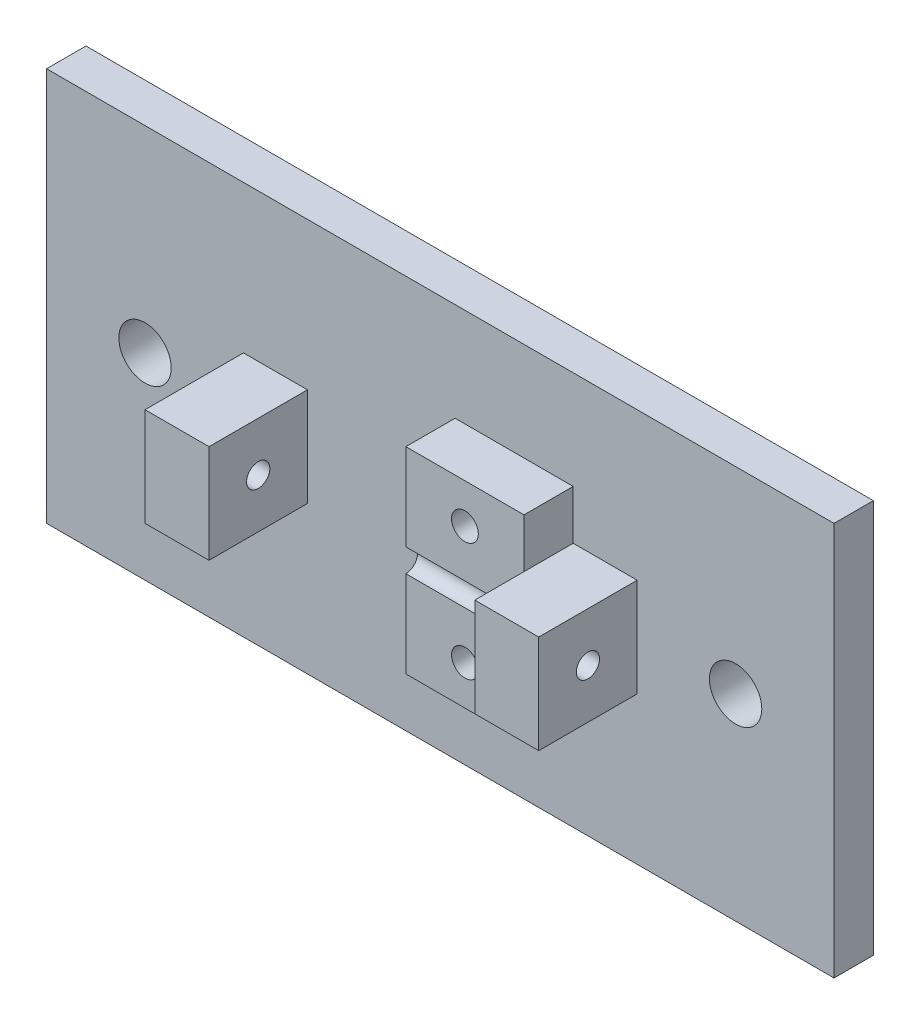
ISO-10303-21;
HEADER;
FILE_DESCRIPTION(('STEP AP214'),'2;1');
FILE_NAME('part.step','',(''),(''),'','','');
FILE_SCHEMA(('AUTOMOTIVE_DESIGN { 1 0 10303 214 1 1 1 1 }'));
ENDSEC;
DATA;
#1=APPLICATION_CONTEXT('core data for automotive mechanical design processes');
#2=APPLICATION_PROTOCOL_DEFINITION('international standard','automotive_design',2000,#1);
#3=PRODUCT_CONTEXT('',#1,'mechanical');
#4=PRODUCT('Part','Part','',(#3));
#5=PRODUCT_RELATED_PRODUCT_CATEGORY('part','',(#4));
#6=PRODUCT_DEFINITION_FORMATION('','',#4);
#7=PRODUCT_DEFINITION_CONTEXT('part definition',#1,'design');
#8=PRODUCT_DEFINITION('design','',#6,#7);
#9=PRODUCT_DEFINITION_SHAPE('','',#8);
#10=(LENGTH_UNIT() NAMED_UNIT(*) SI_UNIT(.MILLI.,.METRE.));
#11=(NAMED_UNIT(*) PLANE_ANGLE_UNIT() SI_UNIT($,.RADIAN.));
#12=(NAMED_UNIT(*) SI_UNIT($,.STERADIAN.) SOLID_ANGLE_UNIT());
#13=UNCERTAINTY_MEASURE_WITH_UNIT(LENGTH_MEASURE(1.E-05),#10,'distance_accuracy_value','');
#14=(GEOMETRIC_REPRESENTATION_CONTEXT(3) GLOBAL_UNCERTAINTY_ASSIGNED_CONTEXT((#13)) GLOBAL_UNIT_ASSIGNED_CONTEXT((#10,
#11,#12)) REPRESENTATION_CONTEXT('',''));
#15=CARTESIAN_POINT('',(0.,0.,0.));
#16=DIRECTION('',(0.,0.,1.));
#17=DIRECTION('',(1.,0.,0.));
#18=AXIS2_PLACEMENT_3D('',#15,#16,#17);
#19=CARTESIAN_POINT('',(0.,0.,5.08));
#20=DIRECTION('',(0.,0.,1.));
#21=DIRECTION('',(1.,0.,0.));
#22=AXIS2_PLACEMENT_3D('',#19,#20,#21);
#23=PLANE('',#22);
#24=DIRECTION('',(-1.,0.,0.));
#25=VECTOR('',#24,1.);
#26=CARTESIAN_POINT('',(0.,-12.7,5.08));
#27=LINE('',#26,#25);
#28=CARTESIAN_POINT('',(17.145,-12.7,5.08));
#29=VERTEX_POINT('',#28);
#30=CARTESIAN_POINT('',(1.90500000000002,-12.7,5.08));
#31=VERTEX_POINT('',#30);
#32=EDGE_CURVE('E200',#29,#31,#27,.T.);
#33=ORIENTED_EDGE('',*,*,#32,.T.);
#34=DIRECTION('',(0.,-1.,0.));
#35=VECTOR('',#34,1.);
#36=CARTESIAN_POINT('',(1.90500000000002,0.,5.08));
#37=LINE('',#36,#35);
#38=CARTESIAN_POINT('',(1.90500000000002,12.7,5.08));
#39=VERTEX_POINT('',#38);
#40=EDGE_CURVE('E186',#39,#31,#37,.T.);
#41=ORIENTED_EDGE('',*,*,#40,.F.);
#42=DIRECTION('',(-1.,0.,0.));
#43=VECTOR('',#42,1.);
#44=CARTESIAN_POINT('',(0.,12.7,5.08));
#45=LINE('',#44,#43);
#46=CARTESIAN_POINT('',(17.145,12.7,5.08));
#47=VERTEX_POINT('',#46);
#48=EDGE_CURVE('E219',#47,#39,#45,.T.);
#49=ORIENTED_EDGE('',*,*,#48,.F.);
#50=DIRECTION('',(0.,-1.,0.));
#51=VECTOR('',#50,1.);
#52=CARTESIAN_POINT('',(17.145,12.7,5.08));
#53=LINE('',#52,#51);
#54=CARTESIAN_POINT('',(17.145,6.35,5.08));
#55=VERTEX_POINT('',#54);
#56=EDGE_CURVE('E225',#47,#55,#53,.T.);
#57=ORIENTED_EDGE('',*,*,#56,.T.);
#58=DIRECTION('',(1.,0.,0.));
#59=VECTOR('',#58,1.);
#60=CARTESIAN_POINT('',(25.4,6.35,5.08));
#61=LINE('',#60,#59);
#62=CARTESIAN_POINT('',(25.4,6.35,5.08));
#63=VERTEX_POINT('',#62);
#64=EDGE_CURVE('E250',#55,#63,#61,.T.);
#65=ORIENTED_EDGE('',*,*,#64,.T.);
#66=DIRECTION('',(0.,-1.,0.));
#67=VECTOR('',#66,1.);
#68=CARTESIAN_POINT('',(25.4,6.35,5.08));
#69=LINE('',#68,#67);
#70=CARTESIAN_POINT('',(25.4,-6.34999999999999,5.08));
#71=VERTEX_POINT('',#70);
#72=EDGE_CURVE('E65',#63,#71,#69,.T.);
#73=ORIENTED_EDGE('',*,*,#72,.T.);
#74=DIRECTION('',(-1.,0.,0.));
#75=VECTOR('',#74,1.);
#76=CARTESIAN_POINT('',(25.4,-6.34999999999999,5.08));
#77=LINE('',#76,#75);
#78=CARTESIAN_POINT('',(17.145,-6.35,5.08));
#79=VERTEX_POINT('',#78);
#80=EDGE_CURVE('E245',#71,#79,#77,.T.);
#81=ORIENTED_EDGE('',*,*,#80,.T.);
#82=DIRECTION('',(0.,1.,0.));
#83=VECTOR('',#82,1.);
#84=CARTESIAN_POINT('',(17.145,-12.7,5.08));
#85=LINE('',#84,#83);
#86=EDGE_CURVE('E211',#29,#79,#85,.T.);
#87=ORIENTED_EDGE('',*,*,#86,.F.);
#88=EDGE_LOOP('',(#33,#41,#49,#57,#65,#73,#81,#87));
#89=FACE_BOUND('',#88,.T.);
#90=CARTESIAN_POINT('',(-38.1,0.,5.08));
#91=DIRECTION('',(0.,0.,1.));
#92=DIRECTION('',(1.,0.,0.));
#93=AXIS2_PLACEMENT_3D('',#90,#91,#92);
#94=CIRCLE('',#93,3.37819999999998);
#95=CARTESIAN_POINT('',(-34.7218,0.,5.08));
#96=VERTEX_POINT('',#95);
#97=EDGE_CURVE('E308',#96,#96,#94,.T.);
#98=ORIENTED_EDGE('',*,*,#97,.F.);
#99=EDGE_LOOP('',(#98));
#100=FACE_BOUND('',#99,.T.);
#101=CARTESIAN_POINT('',(38.1,0.,5.08));
#102=DIRECTION('',(0.,0.,1.));
#103=DIRECTION('',(1.,0.,0.));
#104=AXIS2_PLACEMENT_3D('',#101,#102,#103);
#105=CIRCLE('',#104,3.37819999999998);
#106=CARTESIAN_POINT('',(41.4782,0.,5.08));
#107=VERTEX_POINT('',#106);
#108=EDGE_CURVE('E314',#107,#107,#105,.T.);
#109=ORIENTED_EDGE('',*,*,#108,.F.);
#110=EDGE_LOOP('',(#109));
#111=FACE_BOUND('',#110,.T.);
#112=DIRECTION('',(0.,-1.,0.));
#113=VECTOR('',#112,1.);
#114=CARTESIAN_POINT('',(-50.8,-25.4,5.08));
#115=LINE('',#114,#113);
#116=CARTESIAN_POINT('',(-50.8,25.4,5.08));
#117=VERTEX_POINT('',#116);
#118=CARTESIAN_POINT('',(-50.8,-25.4,5.08));
#119=VERTEX_POINT('',#118);
#120=EDGE_CURVE('E321',#117,#119,#115,.T.);
#121=ORIENTED_EDGE('',*,*,#120,.T.);
#122=DIRECTION('',(1.,0.,0.));
#123=VECTOR('',#122,1.);
#124=CARTESIAN_POINT('',(50.8,-25.4,5.08));
#125=LINE('',#124,#123);
#126=CARTESIAN_POINT('',(50.8,-25.4,5.08));
#127=VERTEX_POINT('',#126);
#128=EDGE_CURVE('E324',#119,#127,#125,.T.);
#129=ORIENTED_EDGE('',*,*,#128,.T.);
#130=DIRECTION('',(0.,1.,0.));
#131=VECTOR('',#130,1.);
#132=CARTESIAN_POINT('',(50.8,-25.4,5.08));
#133=LINE('',#132,#131);
#134=CARTESIAN_POINT('',(50.8,25.4,5.08));
#135=VERTEX_POINT('',#134);
#136=EDGE_CURVE('E327',#127,#135,#133,.T.);
#137=ORIENTED_EDGE('',*,*,#136,.T.);
#138=DIRECTION('',(-1.,0.,0.));
#139=VECTOR('',#138,1.);
#140=CARTESIAN_POINT('',(50.8,25.4,5.08));
#141=LINE('',#140,#139);
#142=EDGE_CURVE('E329',#135,#117,#141,.T.);
#143=ORIENTED_EDGE('',*,*,#142,.T.);
#144=EDGE_LOOP('',(#121,#129,#137,#143));
#145=FACE_BOUND('',#144,.T.);
#146=DIRECTION('',(-1.,0.,0.));
#147=VECTOR('',#146,1.);
#148=CARTESIAN_POINT('',(-25.4,6.35,5.08));
#149=LINE('',#148,#147);
#150=CARTESIAN_POINT('',(-17.145,6.35,5.08));
#151=VERTEX_POINT('',#150);
#152=CARTESIAN_POINT('',(-25.4,6.35,5.08));
#153=VERTEX_POINT('',#152);
#154=EDGE_CURVE('E293',#151,#153,#149,.T.);
#155=ORIENTED_EDGE('',*,*,#154,.F.);
#156=DIRECTION('',(0.,1.,0.));
#157=VECTOR('',#156,1.);
#158=CARTESIAN_POINT('',(-17.145,6.35,5.08));
#159=LINE('',#158,#157);
#160=CARTESIAN_POINT('',(-17.145,-6.34999999999999,5.08));
#161=VERTEX_POINT('',#160);
#162=EDGE_CURVE('E279',#161,#151,#159,.T.);
#163=ORIENTED_EDGE('',*,*,#162,.F.);
#164=DIRECTION('',(1.,0.,0.));
#165=VECTOR('',#164,1.);
#166=CARTESIAN_POINT('',(-25.4,-6.34999999999999,5.08));
#167=LINE('',#166,#165);
#168=CARTESIAN_POINT('',(-25.4,-6.34999999999999,5.08));
#169=VERTEX_POINT('',#168);
#170=EDGE_CURVE('E284',#169,#161,#167,.T.);
#171=ORIENTED_EDGE('',*,*,#170,.F.);
#172=DIRECTION('',(0.,-1.,0.));
#173=VECTOR('',#172,1.);
#174=CARTESIAN_POINT('',(-25.4,6.35,5.08));
#175=LINE('',#174,#173);
#176=EDGE_CURVE('E295',#153,#169,#175,.T.);
#177=ORIENTED_EDGE('',*,*,#176,.F.);
#178=EDGE_LOOP('',(#155,#163,#171,#177));
#179=FACE_BOUND('',#178,.T.);
#180=ADVANCED_FACE('F42',(#89,#100,#111,#145,#179),#23,.T.);
#181=CARTESIAN_POINT('',(25.4,6.35,17.78));
#182=DIRECTION('',(0.,1.,0.));
#183=DIRECTION('',(0.,0.,1.));
#184=AXIS2_PLACEMENT_3D('',#181,#182,#183);
#185=PLANE('',#184);
#186=ORIENTED_EDGE('',*,*,#64,.F.);
#187=DIRECTION('',(0.,0.,-1.));
#188=VECTOR('',#187,1.);
#189=CARTESIAN_POINT('',(17.145,6.35,0.));
#190=LINE('',#189,#188);
#191=CARTESIAN_POINT('',(17.145,6.35,11.43));
#192=VERTEX_POINT('',#191);
#193=EDGE_CURVE('E213',#192,#55,#190,.T.);
#194=ORIENTED_EDGE('',*,*,#193,.F.);
#195=DIRECTION('',(0.,0.,-1.));
#196=VECTOR('',#195,1.);
#197=CARTESIAN_POINT('',(17.145,6.35,17.78));
#198=LINE('',#197,#196);
#199=CARTESIAN_POINT('',(17.145,6.35,17.78));
#200=VERTEX_POINT('',#199);
#201=EDGE_CURVE('E259',#200,#192,#198,.T.);
#202=ORIENTED_EDGE('',*,*,#201,.F.);
#203=DIRECTION('',(1.,0.,0.));
#204=VECTOR('',#203,1.);
#205=CARTESIAN_POINT('',(25.4,6.35,17.78));
#206=LINE('',#205,#204);
#207=CARTESIAN_POINT('',(25.4,6.35,17.78));
#208=VERTEX_POINT('',#207);
#209=EDGE_CURVE('E256',#200,#208,#206,.T.);
#210=ORIENTED_EDGE('',*,*,#209,.T.);
#211=DIRECTION('',(0.,0.,-1.));
#212=VECTOR('',#211,1.);
#213=CARTESIAN_POINT('',(25.4,6.35,17.78));
#214=LINE('',#213,#212);
#215=EDGE_CURVE('E265',#208,#63,#214,.T.);
#216=ORIENTED_EDGE('',*,*,#215,.T.);
#217=EDGE_LOOP('',(#186,#194,#202,#210,#216));
#218=FACE_BOUND('',#217,.T.);
#219=ADVANCED_FACE('F371',(#218),#185,.T.);
#220=CARTESIAN_POINT('',(-50.8,-25.4,5.08));
#221=DIRECTION('',(1.,0.,0.));
#222=DIRECTION('',(0.,0.,-1.));
#223=AXIS2_PLACEMENT_3D('',#220,#221,#222);
#224=PLANE('',#223);
#225=DIRECTION('',(0.,-1.,0.));
#226=VECTOR('',#225,1.);
#227=CARTESIAN_POINT('',(-50.8,-25.4,0.));
#228=LINE('',#227,#226);
#229=CARTESIAN_POINT('',(-50.8,25.4,0.));
#230=VERTEX_POINT('',#229);
#231=CARTESIAN_POINT('',(-50.8,-25.4,0.));
#232=VERTEX_POINT('',#231);
#233=EDGE_CURVE('E320',#230,#232,#228,.T.);
#234=ORIENTED_EDGE('',*,*,#233,.T.);
#235=DIRECTION('',(0.,0.,-1.));
#236=VECTOR('',#235,1.);
#237=CARTESIAN_POINT('',(-50.8,-25.4,5.08));
#238=LINE('',#237,#236);
#239=EDGE_CURVE('E11',#119,#232,#238,.T.);
#240=ORIENTED_EDGE('',*,*,#239,.F.);
#241=ORIENTED_EDGE('',*,*,#120,.F.);
#242=DIRECTION('',(0.,0.,-1.));
#243=VECTOR('',#242,1.);
#244=CARTESIAN_POINT('',(-50.8,25.4,5.08));
#245=LINE('',#244,#243);
#246=EDGE_CURVE('E331',#117,#230,#245,.T.);
#247=ORIENTED_EDGE('',*,*,#246,.T.);
#248=EDGE_LOOP('',(#234,#240,#241,#247));
#249=FACE_BOUND('',#248,.T.);
#250=ADVANCED_FACE('F44',(#249),#224,.F.);
#251=CARTESIAN_POINT('',(50.8,-25.4,5.08));
#252=DIRECTION('',(0.,1.,0.));
#253=DIRECTION('',(-1.,0.,0.));
#254=AXIS2_PLACEMENT_3D('',#251,#252,#253);
#255=PLANE('',#254);
#256=DIRECTION('',(1.,0.,0.));
#257=VECTOR('',#256,1.);
#258=CARTESIAN_POINT('',(50.8,-25.4,0.));
#259=LINE('',#258,#257);
#260=CARTESIAN_POINT('',(50.8,-25.4,0.));
#261=VERTEX_POINT('',#260);
#262=EDGE_CURVE('E334',#232,#261,#259,.T.);
#263=ORIENTED_EDGE('',*,*,#262,.T.);
#264=DIRECTION('',(0.,0.,-1.));
#265=VECTOR('',#264,1.);
#266=CARTESIAN_POINT('',(50.8,-25.4,5.08));
#267=LINE('',#266,#265);
#268=EDGE_CURVE('E50',#127,#261,#267,.T.);
#269=ORIENTED_EDGE('',*,*,#268,.F.);
#270=ORIENTED_EDGE('',*,*,#128,.F.);
#271=ORIENTED_EDGE('',*,*,#239,.T.);
#272=EDGE_LOOP('',(#263,#269,#270,#271));
#273=FACE_BOUND('',#272,.T.);
#274=ADVANCED_FACE('F364',(#273),#255,.F.);
#275=CARTESIAN_POINT('',(50.8,-25.4,5.08));
#276=DIRECTION('',(-1.,0.,0.));
#277=DIRECTION('',(0.,0.,1.));
#278=AXIS2_PLACEMENT_3D('',#275,#276,#277);
#279=PLANE('',#278);
#280=DIRECTION('',(0.,1.,0.));
#281=VECTOR('',#280,1.);
#282=CARTESIAN_POINT('',(50.8,-25.4,0.));
#283=LINE('',#282,#281);
#284=CARTESIAN_POINT('',(50.8,25.4,0.));
#285=VERTEX_POINT('',#284);
#286=EDGE_CURVE('E336',#261,#285,#283,.T.);
#287=ORIENTED_EDGE('',*,*,#286,.T.);
#288=DIRECTION('',(0.,0.,-1.));
#289=VECTOR('',#288,1.);
#290=CARTESIAN_POINT('',(50.8,25.4,5.08));
#291=LINE('',#290,#289);
#292=EDGE_CURVE('E341',#135,#285,#291,.T.);
#293=ORIENTED_EDGE('',*,*,#292,.F.);
#294=ORIENTED_EDGE('',*,*,#136,.F.);
#295=ORIENTED_EDGE('',*,*,#268,.T.);
#296=EDGE_LOOP('',(#287,#293,#294,#295));
#297=FACE_BOUND('',#296,.T.);
#298=ADVANCED_FACE('F348',(#297),#279,.F.);
#299=CARTESIAN_POINT('',(50.8,25.4,5.08));
#300=DIRECTION('',(0.,-1.,0.));
#301=DIRECTION('',(1.,0.,0.));
#302=AXIS2_PLACEMENT_3D('',#299,#300,#301);
#303=PLANE('',#302);
#304=DIRECTION('',(-1.,0.,0.));
#305=VECTOR('',#304,1.);
#306=CARTESIAN_POINT('',(50.8,25.4,0.));
#307=LINE('',#306,#305);
#308=EDGE_CURVE('E325',#285,#230,#307,.T.);
#309=ORIENTED_EDGE('',*,*,#308,.T.);
#310=ORIENTED_EDGE('',*,*,#246,.F.);
#311=ORIENTED_EDGE('',*,*,#142,.F.);
#312=ORIENTED_EDGE('',*,*,#292,.T.);
#313=EDGE_LOOP('',(#309,#310,#311,#312));
#314=FACE_BOUND('',#313,.T.);
#315=ADVANCED_FACE('F357',(#314),#303,.F.);
#316=CARTESIAN_POINT('',(0.,0.,0.));
#317=DIRECTION('',(0.,0.,1.));
#318=DIRECTION('',(1.,0.,0.));
#319=AXIS2_PLACEMENT_3D('',#316,#317,#318);
#320=PLANE('',#319);
#321=CARTESIAN_POINT('',(9.52500000000002,7.62000000000001,0.));
#322=DIRECTION('',(0.,0.,1.));
#323=DIRECTION('',(1.,0.,0.));
#324=AXIS2_PLACEMENT_3D('',#321,#322,#323);
#325=CIRCLE('',#324,1.7272);
#326=CARTESIAN_POINT('',(11.2522,7.62000000000001,0.));
#327=VERTEX_POINT('',#326);
#328=EDGE_CURVE('E684',#327,#327,#325,.T.);
#329=ORIENTED_EDGE('',*,*,#328,.T.);
#330=EDGE_LOOP('',(#329));
#331=FACE_BOUND('',#330,.T.);
#332=CARTESIAN_POINT('',(9.52500000000002,-7.62,0.));
#333=DIRECTION('',(0.,0.,1.));
#334=DIRECTION('',(1.,0.,0.));
#335=AXIS2_PLACEMENT_3D('',#332,#333,#334);
#336=CIRCLE('',#335,1.7272);
#337=CARTESIAN_POINT('',(11.2522,-7.62,0.));
#338=VERTEX_POINT('',#337);
#339=EDGE_CURVE('E209',#338,#338,#336,.T.);
#340=ORIENTED_EDGE('',*,*,#339,.T.);
#341=EDGE_LOOP('',(#340));
#342=FACE_BOUND('',#341,.T.);
#343=CARTESIAN_POINT('',(-38.1,0.,0.));
#344=DIRECTION('',(0.,0.,1.));
#345=DIRECTION('',(1.,0.,0.));
#346=AXIS2_PLACEMENT_3D('',#343,#344,#345);
#347=CIRCLE('',#346,3.3782);
#348=CARTESIAN_POINT('',(-34.7218,0.,0.));
#349=VERTEX_POINT('',#348);
#350=EDGE_CURVE('E311',#349,#349,#347,.T.);
#351=ORIENTED_EDGE('',*,*,#350,.T.);
#352=EDGE_LOOP('',(#351));
#353=FACE_BOUND('',#352,.T.);
#354=CARTESIAN_POINT('',(38.1,0.,0.));
#355=DIRECTION('',(0.,0.,1.));
#356=DIRECTION('',(1.,0.,0.));
#357=AXIS2_PLACEMENT_3D('',#354,#355,#356);
#358=CIRCLE('',#357,3.3782);
#359=CARTESIAN_POINT('',(41.4782,0.,0.));
#360=VERTEX_POINT('',#359);
#361=EDGE_CURVE('E317',#360,#360,#358,.T.);
#362=ORIENTED_EDGE('',*,*,#361,.T.);
#363=EDGE_LOOP('',(#362));
#364=FACE_BOUND('',#363,.T.);
#365=ORIENTED_EDGE('',*,*,#233,.F.);
#366=ORIENTED_EDGE('',*,*,#308,.F.);
#367=ORIENTED_EDGE('',*,*,#286,.F.);
#368=ORIENTED_EDGE('',*,*,#262,.F.);
#369=EDGE_LOOP('',(#365,#366,#367,#368));
#370=FACE_BOUND('',#369,.T.);
#371=ADVANCED_FACE('F354',(#331,#342,#353,#364,#370),#320,.F.);
#372=CARTESIAN_POINT('',(38.1,0.,5.08));
#373=DIRECTION('',(0.,0.,1.));
#374=DIRECTION('',(1.,0.,0.));
#375=AXIS2_PLACEMENT_3D('',#372,#373,#374);
#376=CYLINDRICAL_SURFACE('',#375,3.37819999999999);
#377=ORIENTED_EDGE('',*,*,#361,.F.);
#378=EDGE_LOOP('',(#377));
#379=FACE_BOUND('',#378,.T.);
#380=ORIENTED_EDGE('',*,*,#108,.T.);
#381=EDGE_LOOP('',(#380));
#382=FACE_BOUND('',#381,.T.);
#383=ADVANCED_FACE('F382',(#379,#382),#376,.F.);
#384=CARTESIAN_POINT('',(-38.1,0.,5.08));
#385=DIRECTION('',(0.,0.,1.));
#386=DIRECTION('',(1.,0.,0.));
#387=AXIS2_PLACEMENT_3D('',#384,#385,#386);
#388=CYLINDRICAL_SURFACE('',#387,3.37819999999999);
#389=ORIENTED_EDGE('',*,*,#350,.F.);
#390=EDGE_LOOP('',(#389));
#391=FACE_BOUND('',#390,.T.);
#392=ORIENTED_EDGE('',*,*,#97,.T.);
#393=EDGE_LOOP('',(#392));
#394=FACE_BOUND('',#393,.T.);
#395=ADVANCED_FACE('F404',(#391,#394),#388,.F.);
#396=CARTESIAN_POINT('',(-17.145,6.35,17.78));
#397=DIRECTION('',(-1.,0.,0.));
#398=DIRECTION('',(0.,0.,1.));
#399=AXIS2_PLACEMENT_3D('',#396,#397,#398);
#400=PLANE('',#399);
#401=CARTESIAN_POINT('',(-17.145,0.,11.43));
#402=DIRECTION('',(-1.,0.,0.));
#403=DIRECTION('',(0.,0.,1.));
#404=AXIS2_PLACEMENT_3D('',#401,#402,#403);
#405=CIRCLE('',#404,1.5);
#406=CARTESIAN_POINT('',(-17.145,0.,12.93));
#407=VERTEX_POINT('',#406);
#408=EDGE_CURVE('E276',#407,#407,#405,.T.);
#409=ORIENTED_EDGE('',*,*,#408,.T.);
#410=EDGE_LOOP('',(#409));
#411=FACE_BOUND('',#410,.T.);
#412=ORIENTED_EDGE('',*,*,#162,.T.);
#413=DIRECTION('',(0.,0.,-1.));
#414=VECTOR('',#413,1.);
#415=CARTESIAN_POINT('',(-17.145,6.35,17.78));
#416=LINE('',#415,#414);
#417=CARTESIAN_POINT('',(-17.145,6.35,17.78));
#418=VERTEX_POINT('',#417);
#419=EDGE_CURVE('E306',#418,#151,#416,.T.);
#420=ORIENTED_EDGE('',*,*,#419,.F.);
#421=DIRECTION('',(0.,1.,0.));
#422=VECTOR('',#421,1.);
#423=CARTESIAN_POINT('',(-17.145,6.35,17.78));
#424=LINE('',#423,#422);
#425=CARTESIAN_POINT('',(-17.145,-6.34999999999999,17.78));
#426=VERTEX_POINT('',#425);
#427=EDGE_CURVE('E280',#426,#418,#424,.T.);
#428=ORIENTED_EDGE('',*,*,#427,.F.);
#429=DIRECTION('',(0.,0.,-1.));
#430=VECTOR('',#429,1.);
#431=CARTESIAN_POINT('',(-17.145,-6.34999999999999,17.78));
#432=LINE('',#431,#430);
#433=EDGE_CURVE('E290',#426,#161,#432,.T.);
#434=ORIENTED_EDGE('',*,*,#433,.T.);
#435=EDGE_LOOP('',(#412,#420,#428,#434));
#436=FACE_BOUND('',#435,.T.);
#437=ADVANCED_FACE('F411',(#411,#436),#400,.F.);
#438=CARTESIAN_POINT('',(-25.4,6.35,17.78));
#439=DIRECTION('',(0.,-1.,0.));
#440=DIRECTION('',(0.,0.,-1.));
#441=AXIS2_PLACEMENT_3D('',#438,#439,#440);
#442=PLANE('',#441);
#443=ORIENTED_EDGE('',*,*,#154,.T.);
#444=DIRECTION('',(0.,0.,-1.));
#445=VECTOR('',#444,1.);
#446=CARTESIAN_POINT('',(-25.4,6.35,17.78));
#447=LINE('',#446,#445);
#448=CARTESIAN_POINT('',(-25.4,6.35,17.78));
#449=VERTEX_POINT('',#448);
#450=EDGE_CURVE('E303',#449,#153,#447,.T.);
#451=ORIENTED_EDGE('',*,*,#450,.F.);
#452=DIRECTION('',(-1.,0.,0.));
#453=VECTOR('',#452,1.);
#454=CARTESIAN_POINT('',(-25.4,6.35,17.78));
#455=LINE('',#454,#453);
#456=EDGE_CURVE('E283',#418,#449,#455,.T.);
#457=ORIENTED_EDGE('',*,*,#456,.F.);
#458=ORIENTED_EDGE('',*,*,#419,.T.);
#459=EDGE_LOOP('',(#443,#451,#457,#458));
#460=FACE_BOUND('',#459,.T.);
#461=ADVANCED_FACE('F419',(#460),#442,.F.);
#462=CARTESIAN_POINT('',(-25.4,6.35,17.78));
#463=DIRECTION('',(1.,0.,0.));
#464=DIRECTION('',(0.,1.,0.));
#465=AXIS2_PLACEMENT_3D('',#462,#463,#464);
#466=PLANE('',#465);
#467=CARTESIAN_POINT('',(-25.4,0.,11.43));
#468=DIRECTION('',(-1.,0.,0.));
#469=DIRECTION('',(0.,-1.,0.));
#470=AXIS2_PLACEMENT_3D('',#467,#468,#469);
#471=CIRCLE('',#470,1.5);
#472=CARTESIAN_POINT('',(-25.4,-1.49999999999999,11.43));
#473=VERTEX_POINT('',#472);
#474=EDGE_CURVE('E273',#473,#473,#471,.T.);
#475=ORIENTED_EDGE('',*,*,#474,.F.);
#476=EDGE_LOOP('',(#475));
#477=FACE_BOUND('',#476,.T.);
#478=ORIENTED_EDGE('',*,*,#176,.T.);
#479=DIRECTION('',(0.,0.,-1.));
#480=VECTOR('',#479,1.);
#481=CARTESIAN_POINT('',(-25.4,-6.34999999999999,17.78));
#482=LINE('',#481,#480);
#483=CARTESIAN_POINT('',(-25.4,-6.34999999999999,17.78));
#484=VERTEX_POINT('',#483);
#485=EDGE_CURVE('E301',#484,#169,#482,.T.);
#486=ORIENTED_EDGE('',*,*,#485,.F.);
#487=DIRECTION('',(0.,-1.,0.));
#488=VECTOR('',#487,1.);
#489=CARTESIAN_POINT('',(-25.4,6.35,17.78));
#490=LINE('',#489,#488);
#491=EDGE_CURVE('E286',#449,#484,#490,.T.);
#492=ORIENTED_EDGE('',*,*,#491,.F.);
#493=ORIENTED_EDGE('',*,*,#450,.T.);
#494=EDGE_LOOP('',(#478,#486,#492,#493));
#495=FACE_BOUND('',#494,.T.);
#496=ADVANCED_FACE('F428',(#477,#495),#466,.F.);
#497=CARTESIAN_POINT('',(-25.4,-6.34999999999999,17.78));
#498=DIRECTION('',(0.,1.,0.));
#499=DIRECTION('',(0.,0.,1.));
#500=AXIS2_PLACEMENT_3D('',#497,#498,#499);
#501=PLANE('',#500);
#502=ORIENTED_EDGE('',*,*,#170,.T.);
#503=ORIENTED_EDGE('',*,*,#433,.F.);
#504=DIRECTION('',(1.,0.,0.));
#505=VECTOR('',#504,1.);
#506=CARTESIAN_POINT('',(-25.4,-6.34999999999999,17.78));
#507=LINE('',#506,#505);
#508=EDGE_CURVE('E288',#484,#426,#507,.T.);
#509=ORIENTED_EDGE('',*,*,#508,.F.);
#510=ORIENTED_EDGE('',*,*,#485,.T.);
#511=EDGE_LOOP('',(#502,#503,#509,#510));
#512=FACE_BOUND('',#511,.T.);
#513=ADVANCED_FACE('F436',(#512),#501,.F.);
#514=CARTESIAN_POINT('',(0.,0.,17.78));
#515=DIRECTION('',(0.,0.,1.));
#516=DIRECTION('',(1.,0.,0.));
#517=AXIS2_PLACEMENT_3D('',#514,#515,#516);
#518=PLANE('',#517);
#519=ORIENTED_EDGE('',*,*,#427,.T.);
#520=ORIENTED_EDGE('',*,*,#456,.T.);
#521=ORIENTED_EDGE('',*,*,#491,.T.);
#522=ORIENTED_EDGE('',*,*,#508,.T.);
#523=EDGE_LOOP('',(#519,#520,#521,#522));
#524=FACE_BOUND('',#523,.T.);
#525=ADVANCED_FACE('F444',(#524),#518,.T.);
#526=CARTESIAN_POINT('',(-12.7,0.,11.43));
#527=DIRECTION('',(-1.,0.,0.));
#528=DIRECTION('',(0.,-1.,0.));
#529=AXIS2_PLACEMENT_3D('',#526,#527,#528);
#530=CYLINDRICAL_SURFACE('',#529,1.5);
#531=ORIENTED_EDGE('',*,*,#474,.T.);
#532=EDGE_LOOP('',(#531));
#533=FACE_BOUND('',#532,.T.);
#534=ORIENTED_EDGE('',*,*,#408,.F.);
#535=EDGE_LOOP('',(#534));
#536=FACE_BOUND('',#535,.T.);
#537=ADVANCED_FACE('F451',(#533,#536),#530,.F.);
#538=CARTESIAN_POINT('',(17.145,6.35,17.78));
#539=DIRECTION('',(-1.,0.,0.));
#540=DIRECTION('',(0.,0.,1.));
#541=AXIS2_PLACEMENT_3D('',#538,#539,#540);
#542=PLANE('',#541);
#543=DIRECTION('',(0.,-1.,0.));
#544=VECTOR('',#543,1.);
#545=CARTESIAN_POINT('',(17.145,0.,11.43));
#546=LINE('',#545,#544);
#547=CARTESIAN_POINT('',(17.145,1.50000000000001,11.43));
#548=VERTEX_POINT('',#547);
#549=EDGE_CURVE('E230',#192,#548,#546,.T.);
#550=ORIENTED_EDGE('',*,*,#549,.T.);
#551=CARTESIAN_POINT('',(17.145,0.,11.43));
#552=DIRECTION('',(-1.,0.,0.));
#553=DIRECTION('',(0.,0.,1.));
#554=AXIS2_PLACEMENT_3D('',#551,#552,#553);
#555=CIRCLE('',#554,1.5);
#556=CARTESIAN_POINT('',(17.145,-1.49999999999999,11.43));
#557=VERTEX_POINT('',#556);
#558=EDGE_CURVE('E57',#548,#557,#555,.F.);
#559=ORIENTED_EDGE('',*,*,#558,.T.);
#560=CARTESIAN_POINT('',(17.145,-6.35,11.43));
#561=VERTEX_POINT('',#560);
#562=EDGE_CURVE('E233',#557,#561,#546,.T.);
#563=ORIENTED_EDGE('',*,*,#562,.T.);
#564=DIRECTION('',(0.,0.,-1.));
#565=VECTOR('',#564,1.);
#566=CARTESIAN_POINT('',(17.145,-6.34999999999999,17.78));
#567=LINE('',#566,#565);
#568=CARTESIAN_POINT('',(17.145,-6.34999999999999,17.78));
#569=VERTEX_POINT('',#568);
#570=EDGE_CURVE('E270',#569,#561,#567,.T.);
#571=ORIENTED_EDGE('',*,*,#570,.F.);
#572=DIRECTION('',(0.,1.,0.));
#573=VECTOR('',#572,1.);
#574=CARTESIAN_POINT('',(17.145,6.35,17.78));
#575=LINE('',#574,#573);
#576=EDGE_CURVE('E246',#569,#200,#575,.T.);
#577=ORIENTED_EDGE('',*,*,#576,.T.);
#578=ORIENTED_EDGE('',*,*,#201,.T.);
#579=EDGE_LOOP('',(#550,#559,#563,#571,#577,#578));
#580=FACE_BOUND('',#579,.T.);
#581=ADVANCED_FACE('F458',(#580),#542,.T.);
#582=CARTESIAN_POINT('',(25.4,-6.34999999999999,17.78));
#583=DIRECTION('',(0.,-1.,0.));
#584=DIRECTION('',(0.,0.,-1.));
#585=AXIS2_PLACEMENT_3D('',#582,#583,#584);
#586=PLANE('',#585);
#587=DIRECTION('',(0.,0.,-1.));
#588=VECTOR('',#587,1.);
#589=CARTESIAN_POINT('',(17.145,-6.35,0.));
#590=LINE('',#589,#588);
#591=EDGE_CURVE('E196',#561,#79,#590,.T.);
#592=ORIENTED_EDGE('',*,*,#591,.T.);
#593=ORIENTED_EDGE('',*,*,#80,.F.);
#594=DIRECTION('',(0.,0.,-1.));
#595=VECTOR('',#594,1.);
#596=CARTESIAN_POINT('',(25.4,-6.34999999999999,17.78));
#597=LINE('',#596,#595);
#598=CARTESIAN_POINT('',(25.4,-6.34999999999999,17.78));
#599=VERTEX_POINT('',#598);
#600=EDGE_CURVE('E268',#599,#71,#597,.T.);
#601=ORIENTED_EDGE('',*,*,#600,.F.);
#602=DIRECTION('',(-1.,0.,0.));
#603=VECTOR('',#602,1.);
#604=CARTESIAN_POINT('',(25.4,-6.34999999999999,17.78));
#605=LINE('',#604,#603);
#606=EDGE_CURVE('E249',#599,#569,#605,.T.);
#607=ORIENTED_EDGE('',*,*,#606,.T.);
#608=ORIENTED_EDGE('',*,*,#570,.T.);
#609=EDGE_LOOP('',(#592,#593,#601,#607,#608));
#610=FACE_BOUND('',#609,.T.);
#611=ADVANCED_FACE('F467',(#610),#586,.T.);
#612=CARTESIAN_POINT('',(25.4,6.35,17.78));
#613=DIRECTION('',(1.,0.,0.));
#614=DIRECTION('',(0.,1.,0.));
#615=AXIS2_PLACEMENT_3D('',#612,#613,#614);
#616=PLANE('',#615);
#617=CARTESIAN_POINT('',(25.4,0.,11.43));
#618=DIRECTION('',(-1.,0.,0.));
#619=DIRECTION('',(0.,-1.,0.));
#620=AXIS2_PLACEMENT_3D('',#617,#618,#619);
#621=CIRCLE('',#620,1.5);
#622=CARTESIAN_POINT('',(25.4,-1.49999999999999,11.43));
#623=VERTEX_POINT('',#622);
#624=EDGE_CURVE('E241',#623,#623,#621,.T.);
#625=ORIENTED_EDGE('',*,*,#624,.T.);
#626=EDGE_LOOP('',(#625));
#627=FACE_BOUND('',#626,.T.);
#628=ORIENTED_EDGE('',*,*,#72,.F.);
#629=ORIENTED_EDGE('',*,*,#215,.F.);
#630=DIRECTION('',(0.,-1.,0.));
#631=VECTOR('',#630,1.);
#632=CARTESIAN_POINT('',(25.4,6.35,17.78));
#633=LINE('',#632,#631);
#634=EDGE_CURVE('E253',#208,#599,#633,.T.);
#635=ORIENTED_EDGE('',*,*,#634,.T.);
#636=ORIENTED_EDGE('',*,*,#600,.T.);
#637=EDGE_LOOP('',(#628,#629,#635,#636));
#638=FACE_BOUND('',#637,.T.);
#639=ADVANCED_FACE('F474',(#627,#638),#616,.T.);
#640=CARTESIAN_POINT('',(0.,0.,17.78));
#641=DIRECTION('',(0.,0.,1.));
#642=DIRECTION('',(-1.,0.,0.));
#643=AXIS2_PLACEMENT_3D('',#640,#641,#642);
#644=PLANE('',#643);
#645=ORIENTED_EDGE('',*,*,#576,.F.);
#646=ORIENTED_EDGE('',*,*,#606,.F.);
#647=ORIENTED_EDGE('',*,*,#634,.F.);
#648=ORIENTED_EDGE('',*,*,#209,.F.);
#649=EDGE_LOOP('',(#645,#646,#647,#648));
#650=FACE_BOUND('',#649,.T.);
#651=ADVANCED_FACE('F482',(#650),#644,.T.);
#652=CARTESIAN_POINT('',(12.7,0.,11.43));
#653=DIRECTION('',(1.,0.,0.));
#654=DIRECTION('',(0.,1.,0.));
#655=AXIS2_PLACEMENT_3D('',#652,#653,#654);
#656=CYLINDRICAL_SURFACE('',#655,1.5);
#657=ORIENTED_EDGE('',*,*,#558,.F.);
#658=DIRECTION('',(1.,0.,0.));
#659=VECTOR('',#658,1.);
#660=CARTESIAN_POINT('',(1.90500000000002,1.50000000000001,11.43));
#661=LINE('',#660,#659);
#662=CARTESIAN_POINT('',(1.90500000000002,1.50000000000001,11.43));
#663=VERTEX_POINT('',#662);
#664=EDGE_CURVE('E236',#663,#548,#661,.T.);
#665=ORIENTED_EDGE('',*,*,#664,.F.);
#666=CARTESIAN_POINT('',(1.90500000000002,0.,11.43));
#667=DIRECTION('',(-1.,0.,0.));
#668=DIRECTION('',(0.,0.,1.));
#669=AXIS2_PLACEMENT_3D('',#666,#667,#668);
#670=CIRCLE('',#669,1.5);
#671=CARTESIAN_POINT('',(1.90500000000002,-1.49999999999999,11.43));
#672=VERTEX_POINT('',#671);
#673=EDGE_CURVE('E185',#672,#663,#670,.F.);
#674=ORIENTED_EDGE('',*,*,#673,.F.);
#675=DIRECTION('',(1.,0.,0.));
#676=VECTOR('',#675,1.);
#677=CARTESIAN_POINT('',(1.90500000000002,-1.49999999999999,11.43));
#678=LINE('',#677,#676);
#679=EDGE_CURVE('E181',#672,#557,#678,.T.);
#680=ORIENTED_EDGE('',*,*,#679,.T.);
#681=EDGE_LOOP('',(#657,#665,#674,#680));
#682=FACE_BOUND('',#681,.T.);
#683=ORIENTED_EDGE('',*,*,#624,.F.);
#684=EDGE_LOOP('',(#683));
#685=FACE_BOUND('',#684,.T.);
#686=ADVANCED_FACE('F490',(#682,#685),#656,.F.);
#687=CARTESIAN_POINT('',(1.90500000000002,0.,11.43));
#688=DIRECTION('',(0.,0.,1.));
#689=DIRECTION('',(0.,-1.,0.));
#690=AXIS2_PLACEMENT_3D('',#687,#688,#689);
#691=PLANE('',#690);
#692=CARTESIAN_POINT('',(9.52500000000002,7.62000000000001,11.43));
#693=DIRECTION('',(0.,0.,1.));
#694=DIRECTION('',(1.,0.,0.));
#695=AXIS2_PLACEMENT_3D('',#692,#693,#694);
#696=CIRCLE('',#695,1.7272);
#697=CARTESIAN_POINT('',(11.2522,7.62000000000001,11.43));
#698=VERTEX_POINT('',#697);
#699=EDGE_CURVE('E687',#698,#698,#696,.T.);
#700=ORIENTED_EDGE('',*,*,#699,.F.);
#701=EDGE_LOOP('',(#700));
#702=FACE_BOUND('',#701,.T.);
#703=ORIENTED_EDGE('',*,*,#549,.F.);
#704=DIRECTION('',(0.,-1.,0.));
#705=VECTOR('',#704,1.);
#706=CARTESIAN_POINT('',(17.145,12.7,11.43));
#707=LINE('',#706,#705);
#708=CARTESIAN_POINT('',(17.145,12.7,11.43));
#709=VERTEX_POINT('',#708);
#710=EDGE_CURVE('E229',#709,#192,#707,.T.);
#711=ORIENTED_EDGE('',*,*,#710,.F.);
#712=DIRECTION('',(1.,0.,0.));
#713=VECTOR('',#712,1.);
#714=CARTESIAN_POINT('',(0.,12.7,11.43));
#715=LINE('',#714,#713);
#716=CARTESIAN_POINT('',(1.90500000000002,12.7,11.43));
#717=VERTEX_POINT('',#716);
#718=EDGE_CURVE('E214',#717,#709,#715,.T.);
#719=ORIENTED_EDGE('',*,*,#718,.F.);
#720=DIRECTION('',(0.,-1.,0.));
#721=VECTOR('',#720,1.);
#722=CARTESIAN_POINT('',(1.90500000000002,0.,11.43));
#723=LINE('',#722,#721);
#724=EDGE_CURVE('E188',#717,#663,#723,.T.);
#725=ORIENTED_EDGE('',*,*,#724,.T.);
#726=ORIENTED_EDGE('',*,*,#664,.T.);
#727=EDGE_LOOP('',(#703,#711,#719,#725,#726));
#728=FACE_BOUND('',#727,.T.);
#729=ADVANCED_FACE('F498',(#702,#728),#691,.T.);
#730=CARTESIAN_POINT('',(9.52500000000002,-7.62,11.43));
#731=DIRECTION('',(0.,0.,1.));
#732=DIRECTION('',(1.,0.,0.));
#733=AXIS2_PLACEMENT_3D('',#730,#731,#732);
#734=CIRCLE('',#733,1.7272);
#735=CARTESIAN_POINT('',(11.2522,-7.62,11.43));
#736=VERTEX_POINT('',#735);
#737=EDGE_CURVE('E689',#736,#736,#734,.T.);
#738=ORIENTED_EDGE('',*,*,#737,.F.);
#739=EDGE_LOOP('',(#738));
#740=FACE_BOUND('',#739,.T.);
#741=ORIENTED_EDGE('',*,*,#562,.F.);
#742=ORIENTED_EDGE('',*,*,#679,.F.);
#743=CARTESIAN_POINT('',(1.90500000000002,-12.7,11.43));
#744=VERTEX_POINT('',#743);
#745=EDGE_CURVE('E175',#672,#744,#723,.T.);
#746=ORIENTED_EDGE('',*,*,#745,.T.);
#747=DIRECTION('',(1.,0.,0.));
#748=VECTOR('',#747,1.);
#749=CARTESIAN_POINT('',(0.,-12.7,11.43));
#750=LINE('',#749,#748);
#751=CARTESIAN_POINT('',(17.145,-12.7,11.43));
#752=VERTEX_POINT('',#751);
#753=EDGE_CURVE('E179',#744,#752,#750,.T.);
#754=ORIENTED_EDGE('',*,*,#753,.T.);
#755=DIRECTION('',(0.,1.,0.));
#756=VECTOR('',#755,1.);
#757=CARTESIAN_POINT('',(17.145,-12.7,11.43));
#758=LINE('',#757,#756);
#759=EDGE_CURVE('E206',#752,#561,#758,.T.);
#760=ORIENTED_EDGE('',*,*,#759,.T.);
#761=EDGE_LOOP('',(#741,#742,#746,#754,#760));
#762=FACE_BOUND('',#761,.T.);
#763=ADVANCED_FACE('F178',(#740,#762),#691,.T.);
#764=CARTESIAN_POINT('',(1.90500000000002,0.,0.));
#765=DIRECTION('',(-1.,0.,0.));
#766=DIRECTION('',(0.,0.,1.));
#767=AXIS2_PLACEMENT_3D('',#764,#765,#766);
#768=PLANE('',#767);
#769=ORIENTED_EDGE('',*,*,#724,.F.);
#770=DIRECTION('',(0.,0.,1.));
#771=VECTOR('',#770,1.);
#772=CARTESIAN_POINT('',(1.90500000000002,12.7,0.));
#773=LINE('',#772,#771);
#774=EDGE_CURVE('E222',#39,#717,#773,.T.);
#775=ORIENTED_EDGE('',*,*,#774,.F.);
#776=ORIENTED_EDGE('',*,*,#40,.T.);
#777=DIRECTION('',(0.,0.,1.));
#778=VECTOR('',#777,1.);
#779=CARTESIAN_POINT('',(1.90500000000002,-12.7,0.));
#780=LINE('',#779,#778);
#781=EDGE_CURVE('E192',#31,#744,#780,.T.);
#782=ORIENTED_EDGE('',*,*,#781,.T.);
#783=ORIENTED_EDGE('',*,*,#745,.F.);
#784=ORIENTED_EDGE('',*,*,#673,.T.);
#785=EDGE_LOOP('',(#769,#775,#776,#782,#783,#784));
#786=FACE_BOUND('',#785,.T.);
#787=ADVANCED_FACE('F198',(#786),#768,.T.);
#788=CARTESIAN_POINT('',(17.145,12.7,0.));
#789=DIRECTION('',(-1.,0.,0.));
#790=DIRECTION('',(0.,0.,1.));
#791=AXIS2_PLACEMENT_3D('',#788,#789,#790);
#792=PLANE('',#791);
#793=ORIENTED_EDGE('',*,*,#193,.T.);
#794=ORIENTED_EDGE('',*,*,#56,.F.);
#795=DIRECTION('',(0.,0.,-1.));
#796=VECTOR('',#795,1.);
#797=CARTESIAN_POINT('',(17.145,12.7,0.));
#798=LINE('',#797,#796);
#799=EDGE_CURVE('E217',#709,#47,#798,.T.);
#800=ORIENTED_EDGE('',*,*,#799,.F.);
#801=ORIENTED_EDGE('',*,*,#710,.T.);
#802=EDGE_LOOP('',(#793,#794,#800,#801));
#803=FACE_BOUND('',#802,.T.);
#804=ADVANCED_FACE('F519',(#803),#792,.F.);
#805=CARTESIAN_POINT('',(0.,12.7,0.));
#806=DIRECTION('',(0.,1.,0.));
#807=DIRECTION('',(0.,0.,1.));
#808=AXIS2_PLACEMENT_3D('',#805,#806,#807);
#809=PLANE('',#808);
#810=ORIENTED_EDGE('',*,*,#718,.T.);
#811=ORIENTED_EDGE('',*,*,#799,.T.);
#812=ORIENTED_EDGE('',*,*,#48,.T.);
#813=ORIENTED_EDGE('',*,*,#774,.T.);
#814=EDGE_LOOP('',(#810,#811,#812,#813));
#815=FACE_BOUND('',#814,.T.);
#816=ADVANCED_FACE('F527',(#815),#809,.T.);
#817=CARTESIAN_POINT('',(17.145,-12.7,0.));
#818=DIRECTION('',(1.,0.,0.));
#819=DIRECTION('',(0.,0.,-1.));
#820=AXIS2_PLACEMENT_3D('',#817,#818,#819);
#821=PLANE('',#820);
#822=ORIENTED_EDGE('',*,*,#591,.F.);
#823=ORIENTED_EDGE('',*,*,#759,.F.);
#824=DIRECTION('',(0.,0.,-1.));
#825=VECTOR('',#824,1.);
#826=CARTESIAN_POINT('',(17.145,-12.7,0.));
#827=LINE('',#826,#825);
#828=EDGE_CURVE('E195',#752,#29,#827,.T.);
#829=ORIENTED_EDGE('',*,*,#828,.T.);
#830=ORIENTED_EDGE('',*,*,#86,.T.);
#831=EDGE_LOOP('',(#822,#823,#829,#830));
#832=FACE_BOUND('',#831,.T.);
#833=ADVANCED_FACE('F535',(#832),#821,.T.);
#834=CARTESIAN_POINT('',(0.,-12.7,0.));
#835=DIRECTION('',(0.,-1.,0.));
#836=DIRECTION('',(0.,0.,1.));
#837=AXIS2_PLACEMENT_3D('',#834,#835,#836);
#838=PLANE('',#837);
#839=ORIENTED_EDGE('',*,*,#753,.F.);
#840=ORIENTED_EDGE('',*,*,#781,.F.);
#841=ORIENTED_EDGE('',*,*,#32,.F.);
#842=ORIENTED_EDGE('',*,*,#828,.F.);
#843=EDGE_LOOP('',(#839,#840,#841,#842));
#844=FACE_BOUND('',#843,.T.);
#845=ADVANCED_FACE('F191',(#844),#838,.T.);
#846=CARTESIAN_POINT('',(9.52500000000002,-7.62,11.43));
#847=DIRECTION('',(0.,0.,1.));
#848=DIRECTION('',(1.,0.,0.));
#849=AXIS2_PLACEMENT_3D('',#846,#847,#848);
#850=CYLINDRICAL_SURFACE('',#849,1.7272);
#851=ORIENTED_EDGE('',*,*,#339,.F.);
#852=EDGE_LOOP('',(#851));
#853=FACE_BOUND('',#852,.T.);
#854=ORIENTED_EDGE('',*,*,#737,.T.);
#855=EDGE_LOOP('',(#854));
#856=FACE_BOUND('',#855,.T.);
#857=ADVANCED_FACE('F548',(#853,#856),#850,.F.);
#858=CARTESIAN_POINT('',(9.52500000000002,7.62000000000001,11.43));
#859=DIRECTION('',(0.,0.,1.));
#860=DIRECTION('',(1.,0.,0.));
#861=AXIS2_PLACEMENT_3D('',#858,#859,#860);
#862=CYLINDRICAL_SURFACE('',#861,1.7272);
#863=ORIENTED_EDGE('',*,*,#328,.F.);
#864=EDGE_LOOP('',(#863));
#865=FACE_BOUND('',#864,.T.);
#866=ORIENTED_EDGE('',*,*,#699,.T.);
#867=EDGE_LOOP('',(#866));
#868=FACE_BOUND('',#867,.T.);
#869=ADVANCED_FACE('F554',(#865,#868),#862,.F.);
#870=CLOSED_SHELL('',(#180,#219,#250,#274,#298,#315,#371,#383,#395,#437,#461,#496,#513,#525,
#537,#581,#611,#639,#651,#686,#729,#763,#787,#804,#816,#833,#845,#857,#869));
#871=MANIFOLD_SOLID_BREP('B2',#870);
#872=ADVANCED_BREP_SHAPE_REPRESENTATION('',(#18,#871),#14);
#873=SHAPE_DEFINITION_REPRESENTATION(#9,#872);
ENDSEC;
END-ISO-10303-21;
